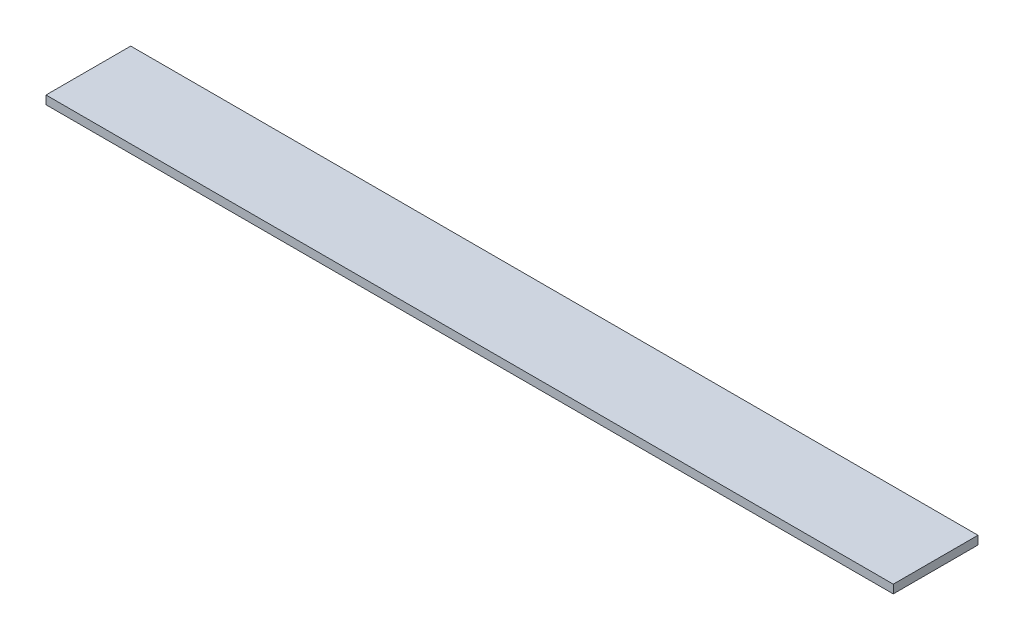
ISO-10303-21;
HEADER;
FILE_DESCRIPTION(('STEP AP214'),'2;1');
FILE_NAME('part.step','',(''),(''),'','','');
FILE_SCHEMA(('AUTOMOTIVE_DESIGN { 1 0 10303 214 1 1 1 1 }'));
ENDSEC;
DATA;
#1=APPLICATION_CONTEXT('core data for automotive mechanical design processes');
#2=APPLICATION_PROTOCOL_DEFINITION('international standard','automotive_design',2000,#1);
#3=PRODUCT_CONTEXT('',#1,'mechanical');
#4=PRODUCT('Part','Part','',(#3));
#5=PRODUCT_RELATED_PRODUCT_CATEGORY('part','',(#4));
#6=PRODUCT_DEFINITION_FORMATION('','',#4);
#7=PRODUCT_DEFINITION_CONTEXT('part definition',#1,'design');
#8=PRODUCT_DEFINITION('design','',#6,#7);
#9=PRODUCT_DEFINITION_SHAPE('','',#8);
#10=(LENGTH_UNIT() NAMED_UNIT(*) SI_UNIT(.MILLI.,.METRE.));
#11=(NAMED_UNIT(*) PLANE_ANGLE_UNIT() SI_UNIT($,.RADIAN.));
#12=(NAMED_UNIT(*) SI_UNIT($,.STERADIAN.) SOLID_ANGLE_UNIT());
#13=UNCERTAINTY_MEASURE_WITH_UNIT(LENGTH_MEASURE(1.E-05),#10,'distance_accuracy_value','');
#14=(GEOMETRIC_REPRESENTATION_CONTEXT(3) GLOBAL_UNCERTAINTY_ASSIGNED_CONTEXT((#13)) GLOBAL_UNIT_ASSIGNED_CONTEXT((#10,
#11,#12)) REPRESENTATION_CONTEXT('',''));
#15=CARTESIAN_POINT('',(0.,0.,0.));
#16=DIRECTION('',(0.,0.,1.));
#17=DIRECTION('',(1.,0.,0.));
#18=AXIS2_PLACEMENT_3D('',#15,#16,#17);
#19=CARTESIAN_POINT('',(-10.,0.2,-1.));
#20=DIRECTION('',(1.,0.,0.));
#21=DIRECTION('',(0.,0.,-1.));
#22=AXIS2_PLACEMENT_3D('',#19,#20,#21);
#23=PLANE('',#22);
#24=DIRECTION('',(0.,0.,1.));
#25=VECTOR('',#24,1.);
#26=CARTESIAN_POINT('',(-10.,0.,-1.));
#27=LINE('',#26,#25);
#28=CARTESIAN_POINT('',(-10.,0.,-1.));
#29=VERTEX_POINT('',#28);
#30=CARTESIAN_POINT('',(-10.,0.,1.));
#31=VERTEX_POINT('',#30);
#32=EDGE_CURVE('E11',#29,#31,#27,.T.);
#33=ORIENTED_EDGE('',*,*,#32,.T.);
#34=DIRECTION('',(0.,-1.,0.));
#35=VECTOR('',#34,1.);
#36=CARTESIAN_POINT('',(-10.,0.2,1.));
#37=LINE('',#36,#35);
#38=CARTESIAN_POINT('',(-10.,0.2,1.));
#39=VERTEX_POINT('',#38);
#40=EDGE_CURVE('E35',#39,#31,#37,.T.);
#41=ORIENTED_EDGE('',*,*,#40,.F.);
#42=DIRECTION('',(0.,0.,1.));
#43=VECTOR('',#42,1.);
#44=CARTESIAN_POINT('',(-10.,0.2,-1.));
#45=LINE('',#44,#43);
#46=CARTESIAN_POINT('',(-10.,0.2,-1.));
#47=VERTEX_POINT('',#46);
#48=EDGE_CURVE('E72',#47,#39,#45,.T.);
#49=ORIENTED_EDGE('',*,*,#48,.F.);
#50=DIRECTION('',(0.,-1.,0.));
#51=VECTOR('',#50,1.);
#52=CARTESIAN_POINT('',(-10.,0.2,-1.));
#53=LINE('',#52,#51);
#54=EDGE_CURVE('E26',#47,#29,#53,.T.);
#55=ORIENTED_EDGE('',*,*,#54,.T.);
#56=EDGE_LOOP('',(#33,#41,#49,#55));
#57=FACE_BOUND('',#56,.T.);
#58=ADVANCED_FACE('F16',(#57),#23,.F.);
#59=CARTESIAN_POINT('',(-10.,0.2,1.));
#60=DIRECTION('',(0.,0.,-1.));
#61=DIRECTION('',(-1.,0.,0.));
#62=AXIS2_PLACEMENT_3D('',#59,#60,#61);
#63=PLANE('',#62);
#64=DIRECTION('',(1.,0.,0.));
#65=VECTOR('',#64,1.);
#66=CARTESIAN_POINT('',(-10.,0.,1.));
#67=LINE('',#66,#65);
#68=CARTESIAN_POINT('',(10.,0.,0.999999999999997));
#69=VERTEX_POINT('',#68);
#70=EDGE_CURVE('E79',#31,#69,#67,.T.);
#71=ORIENTED_EDGE('',*,*,#70,.T.);
#72=DIRECTION('',(0.,-1.,0.));
#73=VECTOR('',#72,1.);
#74=CARTESIAN_POINT('',(10.,0.2,0.999999999999997));
#75=LINE('',#74,#73);
#76=CARTESIAN_POINT('',(10.,0.2,0.999999999999997));
#77=VERTEX_POINT('',#76);
#78=EDGE_CURVE('E85',#77,#69,#75,.T.);
#79=ORIENTED_EDGE('',*,*,#78,.F.);
#80=DIRECTION('',(1.,0.,0.));
#81=VECTOR('',#80,1.);
#82=CARTESIAN_POINT('',(-10.,0.2,1.));
#83=LINE('',#82,#81);
#84=EDGE_CURVE('E63',#39,#77,#83,.T.);
#85=ORIENTED_EDGE('',*,*,#84,.F.);
#86=ORIENTED_EDGE('',*,*,#40,.T.);
#87=EDGE_LOOP('',(#71,#79,#85,#86));
#88=FACE_BOUND('',#87,.T.);
#89=ADVANCED_FACE('F89',(#88),#63,.F.);
#90=CARTESIAN_POINT('',(10.,0.2,-1.));
#91=DIRECTION('',(-1.,0.,0.));
#92=DIRECTION('',(0.,0.,1.));
#93=AXIS2_PLACEMENT_3D('',#90,#91,#92);
#94=PLANE('',#93);
#95=DIRECTION('',(0.,0.,-1.));
#96=VECTOR('',#95,1.);
#97=CARTESIAN_POINT('',(10.,0.,-1.));
#98=LINE('',#97,#96);
#99=CARTESIAN_POINT('',(10.,0.,-1.));
#100=VERTEX_POINT('',#99);
#101=EDGE_CURVE('E69',#69,#100,#98,.T.);
#102=ORIENTED_EDGE('',*,*,#101,.T.);
#103=DIRECTION('',(0.,-1.,0.));
#104=VECTOR('',#103,1.);
#105=CARTESIAN_POINT('',(10.,0.2,-1.));
#106=LINE('',#105,#104);
#107=CARTESIAN_POINT('',(10.,0.2,-1.));
#108=VERTEX_POINT('',#107);
#109=EDGE_CURVE('E55',#108,#100,#106,.T.);
#110=ORIENTED_EDGE('',*,*,#109,.F.);
#111=DIRECTION('',(0.,0.,-1.));
#112=VECTOR('',#111,1.);
#113=CARTESIAN_POINT('',(10.,0.2,-1.));
#114=LINE('',#113,#112);
#115=EDGE_CURVE('E61',#77,#108,#114,.T.);
#116=ORIENTED_EDGE('',*,*,#115,.F.);
#117=ORIENTED_EDGE('',*,*,#78,.T.);
#118=EDGE_LOOP('',(#102,#110,#116,#117));
#119=FACE_BOUND('',#118,.T.);
#120=ADVANCED_FACE('F67',(#119),#94,.F.);
#121=CARTESIAN_POINT('',(-10.,0.2,-1.));
#122=DIRECTION('',(0.,0.,1.));
#123=DIRECTION('',(1.,0.,0.));
#124=AXIS2_PLACEMENT_3D('',#121,#122,#123);
#125=PLANE('',#124);
#126=DIRECTION('',(-1.,0.,0.));
#127=VECTOR('',#126,1.);
#128=CARTESIAN_POINT('',(-10.,0.,-1.));
#129=LINE('',#128,#127);
#130=EDGE_CURVE('E71',#100,#29,#129,.T.);
#131=ORIENTED_EDGE('',*,*,#130,.T.);
#132=ORIENTED_EDGE('',*,*,#54,.F.);
#133=DIRECTION('',(-1.,0.,0.));
#134=VECTOR('',#133,1.);
#135=CARTESIAN_POINT('',(-10.,0.2,-1.));
#136=LINE('',#135,#134);
#137=EDGE_CURVE('E20',#108,#47,#136,.T.);
#138=ORIENTED_EDGE('',*,*,#137,.F.);
#139=ORIENTED_EDGE('',*,*,#109,.T.);
#140=EDGE_LOOP('',(#131,#132,#138,#139));
#141=FACE_BOUND('',#140,.T.);
#142=ADVANCED_FACE('F75',(#141),#125,.F.);
#143=CARTESIAN_POINT('',(0.,0.2,0.));
#144=DIRECTION('',(0.,1.,0.));
#145=DIRECTION('',(0.,0.,1.));
#146=AXIS2_PLACEMENT_3D('',#143,#144,#145);
#147=PLANE('',#146);
#148=ORIENTED_EDGE('',*,*,#48,.T.);
#149=ORIENTED_EDGE('',*,*,#84,.T.);
#150=ORIENTED_EDGE('',*,*,#115,.T.);
#151=ORIENTED_EDGE('',*,*,#137,.T.);
#152=EDGE_LOOP('',(#148,#149,#150,#151));
#153=FACE_BOUND('',#152,.T.);
#154=ADVANCED_FACE('F62',(#153),#147,.T.);
#155=CARTESIAN_POINT('',(0.,0.,0.));
#156=DIRECTION('',(0.,1.,0.));
#157=DIRECTION('',(0.,0.,1.));
#158=AXIS2_PLACEMENT_3D('',#155,#156,#157);
#159=PLANE('',#158);
#160=ORIENTED_EDGE('',*,*,#32,.F.);
#161=ORIENTED_EDGE('',*,*,#130,.F.);
#162=ORIENTED_EDGE('',*,*,#101,.F.);
#163=ORIENTED_EDGE('',*,*,#70,.F.);
#164=EDGE_LOOP('',(#160,#161,#162,#163));
#165=FACE_BOUND('',#164,.T.);
#166=ADVANCED_FACE('F18',(#165),#159,.F.);
#167=CLOSED_SHELL('',(#58,#89,#120,#142,#154,#166));
#168=MANIFOLD_SOLID_BREP('B1',#167);
#169=ADVANCED_BREP_SHAPE_REPRESENTATION('',(#18,#168),#14);
#170=SHAPE_DEFINITION_REPRESENTATION(#9,#169);
ENDSEC;
END-ISO-10303-21;
